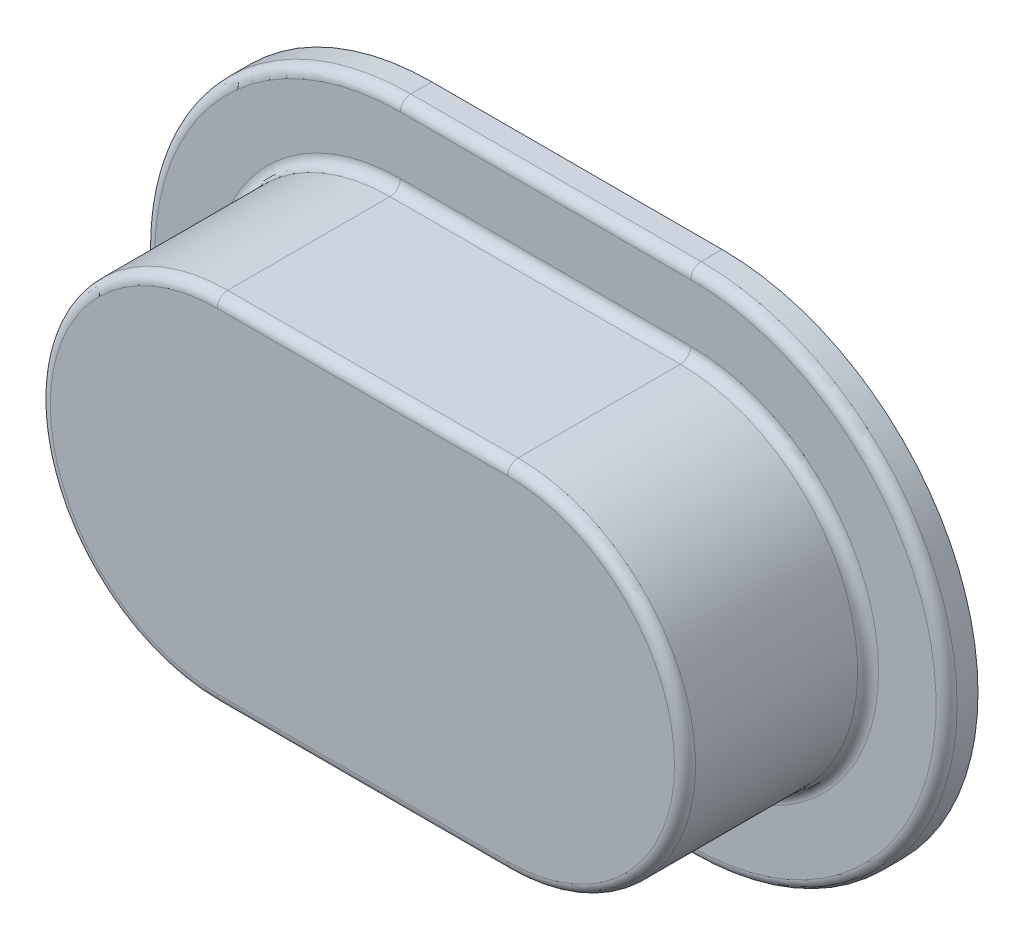
ISO-10303-21;
HEADER;
FILE_DESCRIPTION(('STEP AP214'),'2;1');
FILE_NAME('part.step','',(''),(''),'','','');
FILE_SCHEMA(('AUTOMOTIVE_DESIGN { 1 0 10303 214 1 1 1 1 }'));
ENDSEC;
DATA;
#1=APPLICATION_CONTEXT('core data for automotive mechanical design processes');
#2=APPLICATION_PROTOCOL_DEFINITION('international standard','automotive_design',2000,#1);
#3=PRODUCT_CONTEXT('',#1,'mechanical');
#4=PRODUCT('Part','Part','',(#3));
#5=PRODUCT_RELATED_PRODUCT_CATEGORY('part','',(#4));
#6=PRODUCT_DEFINITION_FORMATION('','',#4);
#7=PRODUCT_DEFINITION_CONTEXT('part definition',#1,'design');
#8=PRODUCT_DEFINITION('design','',#6,#7);
#9=PRODUCT_DEFINITION_SHAPE('','',#8);
#10=(LENGTH_UNIT() NAMED_UNIT(*) SI_UNIT(.MILLI.,.METRE.));
#11=(NAMED_UNIT(*) PLANE_ANGLE_UNIT() SI_UNIT($,.RADIAN.));
#12=(NAMED_UNIT(*) SI_UNIT($,.STERADIAN.) SOLID_ANGLE_UNIT());
#13=UNCERTAINTY_MEASURE_WITH_UNIT(LENGTH_MEASURE(1.E-05),#10,'distance_accuracy_value','');
#14=(GEOMETRIC_REPRESENTATION_CONTEXT(3) GLOBAL_UNCERTAINTY_ASSIGNED_CONTEXT((#13)) GLOBAL_UNIT_ASSIGNED_CONTEXT((#10,
#11,#12)) REPRESENTATION_CONTEXT('',''));
#15=CARTESIAN_POINT('',(0.,0.,0.));
#16=DIRECTION('',(0.,0.,1.));
#17=DIRECTION('',(1.,0.,0.));
#18=AXIS2_PLACEMENT_3D('',#15,#16,#17);
#19=CARTESIAN_POINT('',(-27.4999999999999,90.5,6.));
#20=DIRECTION('',(0.,0.,-1.));
#21=DIRECTION('',(-1.,0.,0.));
#22=AXIS2_PLACEMENT_3D('',#19,#20,#21);
#23=CYLINDRICAL_SURFACE('',#22,48.9085956407228);
#24=DIRECTION('',(0.,0.,-1.));
#25=VECTOR('',#24,1.);
#26=CARTESIAN_POINT('',(-27.4999999999999,41.5914043592772,6.));
#27=LINE('',#26,#25);
#28=CARTESIAN_POINT('',(-27.4999999999999,41.5914043592772,4.));
#29=VERTEX_POINT('',#28);
#30=CARTESIAN_POINT('',(-27.4999999999999,41.5914043592772,0.));
#31=VERTEX_POINT('',#30);
#32=EDGE_CURVE('E368',#29,#31,#27,.T.);
#33=ORIENTED_EDGE('',*,*,#32,.F.);
#34=CARTESIAN_POINT('',(-27.4999999999999,90.5,4.));
#35=DIRECTION('',(0.,0.,1.));
#36=DIRECTION('',(1.,0.,0.));
#37=AXIS2_PLACEMENT_3D('',#34,#35,#36);
#38=CIRCLE('',#37,48.9085956407228);
#39=CARTESIAN_POINT('',(-27.4999999999999,139.408595640723,4.));
#40=VERTEX_POINT('',#39);
#41=EDGE_CURVE('E421',#29,#40,#38,.F.);
#42=ORIENTED_EDGE('',*,*,#41,.T.);
#43=DIRECTION('',(0.,0.,-1.));
#44=VECTOR('',#43,1.);
#45=CARTESIAN_POINT('',(-27.4999999999999,139.408595640723,6.));
#46=LINE('',#45,#44);
#47=CARTESIAN_POINT('',(-27.4999999999999,139.408595640723,0.));
#48=VERTEX_POINT('',#47);
#49=EDGE_CURVE('E359',#40,#48,#46,.T.);
#50=ORIENTED_EDGE('',*,*,#49,.T.);
#51=CARTESIAN_POINT('',(-27.4999999999999,90.5,0.));
#52=DIRECTION('',(0.,0.,1.));
#53=DIRECTION('',(1.,0.,0.));
#54=AXIS2_PLACEMENT_3D('',#51,#52,#53);
#55=CIRCLE('',#54,48.9085956407228);
#56=EDGE_CURVE('E343',#48,#31,#55,.T.);
#57=ORIENTED_EDGE('',*,*,#56,.T.);
#58=EDGE_LOOP('',(#33,#42,#50,#57));
#59=FACE_BOUND('',#58,.T.);
#60=ADVANCED_FACE('F38',(#59),#23,.T.);
#61=CARTESIAN_POINT('',(-27.4999999999999,41.5914043592772,6.));
#62=DIRECTION('',(0.,1.,0.));
#63=DIRECTION('',(-1.,0.,0.));
#64=AXIS2_PLACEMENT_3D('',#61,#62,#63);
#65=PLANE('',#64);
#66=DIRECTION('',(0.,0.,-1.));
#67=VECTOR('',#66,1.);
#68=CARTESIAN_POINT('',(27.9999999999998,41.5914043592773,6.));
#69=LINE('',#68,#67);
#70=CARTESIAN_POINT('',(27.9999999999998,41.5914043592773,4.));
#71=VERTEX_POINT('',#70);
#72=CARTESIAN_POINT('',(27.9999999999998,41.5914043592773,0.));
#73=VERTEX_POINT('',#72);
#74=EDGE_CURVE('E365',#71,#73,#69,.T.);
#75=ORIENTED_EDGE('',*,*,#74,.F.);
#76=DIRECTION('',(1.,0.,0.));
#77=VECTOR('',#76,1.);
#78=CARTESIAN_POINT('',(-27.4999999999999,41.5914043592772,4.));
#79=LINE('',#78,#77);
#80=EDGE_CURVE('E417',#71,#29,#79,.F.);
#81=ORIENTED_EDGE('',*,*,#80,.T.);
#82=ORIENTED_EDGE('',*,*,#32,.T.);
#83=DIRECTION('',(1.,0.,0.));
#84=VECTOR('',#83,1.);
#85=CARTESIAN_POINT('',(-27.4999999999999,41.5914043592772,0.));
#86=LINE('',#85,#84);
#87=EDGE_CURVE('E347',#31,#73,#86,.T.);
#88=ORIENTED_EDGE('',*,*,#87,.T.);
#89=EDGE_LOOP('',(#75,#81,#82,#88));
#90=FACE_BOUND('',#89,.T.);
#91=ADVANCED_FACE('F538',(#90),#65,.F.);
#92=CARTESIAN_POINT('',(27.9999999999998,90.5000000000001,6.));
#93=DIRECTION('',(0.,0.,-1.));
#94=DIRECTION('',(-1.,0.,0.));
#95=AXIS2_PLACEMENT_3D('',#92,#93,#94);
#96=CYLINDRICAL_SURFACE('',#95,48.9085956407228);
#97=DIRECTION('',(0.,0.,-1.));
#98=VECTOR('',#97,1.);
#99=CARTESIAN_POINT('',(27.9999999999998,139.408595640723,6.));
#100=LINE('',#99,#98);
#101=CARTESIAN_POINT('',(27.9999999999998,139.408595640723,4.));
#102=VERTEX_POINT('',#101);
#103=CARTESIAN_POINT('',(27.9999999999998,139.408595640723,0.));
#104=VERTEX_POINT('',#103);
#105=EDGE_CURVE('E362',#102,#104,#100,.T.);
#106=ORIENTED_EDGE('',*,*,#105,.F.);
#107=CARTESIAN_POINT('',(27.9999999999998,90.5000000000001,4.));
#108=DIRECTION('',(0.,0.,1.));
#109=DIRECTION('',(1.,0.,0.));
#110=AXIS2_PLACEMENT_3D('',#107,#108,#109);
#111=CIRCLE('',#110,48.9085956407228);
#112=EDGE_CURVE('E11',#102,#71,#111,.F.);
#113=ORIENTED_EDGE('',*,*,#112,.T.);
#114=ORIENTED_EDGE('',*,*,#74,.T.);
#115=CARTESIAN_POINT('',(27.9999999999998,90.5000000000001,0.));
#116=DIRECTION('',(0.,0.,1.));
#117=DIRECTION('',(1.,0.,0.));
#118=AXIS2_PLACEMENT_3D('',#115,#116,#117);
#119=CIRCLE('',#118,48.9085956407228);
#120=EDGE_CURVE('E351',#73,#104,#119,.T.);
#121=ORIENTED_EDGE('',*,*,#120,.T.);
#122=EDGE_LOOP('',(#106,#113,#114,#121));
#123=FACE_BOUND('',#122,.T.);
#124=ADVANCED_FACE('F544',(#123),#96,.T.);
#125=CARTESIAN_POINT('',(-27.4999999999999,139.408595640723,6.));
#126=DIRECTION('',(0.,-1.,0.));
#127=DIRECTION('',(0.,0.,-1.));
#128=AXIS2_PLACEMENT_3D('',#125,#126,#127);
#129=PLANE('',#128);
#130=ORIENTED_EDGE('',*,*,#49,.F.);
#131=DIRECTION('',(-1.,0.,0.));
#132=VECTOR('',#131,1.);
#133=CARTESIAN_POINT('',(27.9999999999998,139.408595640723,4.));
#134=LINE('',#133,#132);
#135=EDGE_CURVE('E424',#40,#102,#134,.F.);
#136=ORIENTED_EDGE('',*,*,#135,.T.);
#137=ORIENTED_EDGE('',*,*,#105,.T.);
#138=DIRECTION('',(-1.,0.,0.));
#139=VECTOR('',#138,1.);
#140=CARTESIAN_POINT('',(-27.4999999999999,139.408595640723,0.));
#141=LINE('',#140,#139);
#142=EDGE_CURVE('E355',#104,#48,#141,.T.);
#143=ORIENTED_EDGE('',*,*,#142,.T.);
#144=EDGE_LOOP('',(#130,#136,#137,#143));
#145=FACE_BOUND('',#144,.T.);
#146=ADVANCED_FACE('F653',(#145),#129,.F.);
#147=CARTESIAN_POINT('',(-27.4999999999999,90.5,6.));
#148=DIRECTION('',(0.,0.,1.));
#149=DIRECTION('',(1.,0.,0.));
#150=AXIS2_PLACEMENT_3D('',#147,#148,#149);
#151=PLANE('',#150);
#152=DIRECTION('',(-1.,0.,0.));
#153=VECTOR('',#152,1.);
#154=CARTESIAN_POINT('',(-27.4999999999999,126.408595640723,6.));
#155=LINE('',#154,#153);
#156=CARTESIAN_POINT('',(-27.4999999999999,126.408595640723,6.));
#157=VERTEX_POINT('',#156);
#158=CARTESIAN_POINT('',(27.9999999999998,126.408595640723,6.));
#159=VERTEX_POINT('',#158);
#160=EDGE_CURVE('E391',#157,#159,#155,.F.);
#161=ORIENTED_EDGE('',*,*,#160,.T.);
#162=CARTESIAN_POINT('',(27.9999999999998,90.5000000000001,6.));
#163=DIRECTION('',(0.,0.,1.));
#164=DIRECTION('',(1.,0.,0.));
#165=AXIS2_PLACEMENT_3D('',#162,#163,#164);
#166=CIRCLE('',#165,35.9085956407228);
#167=CARTESIAN_POINT('',(27.9999999999997,54.5914043592773,6.));
#168=VERTEX_POINT('',#167);
#169=EDGE_CURVE('E400',#159,#168,#166,.F.);
#170=ORIENTED_EDGE('',*,*,#169,.T.);
#171=DIRECTION('',(1.,0.,0.));
#172=VECTOR('',#171,1.);
#173=CARTESIAN_POINT('',(-27.4999999999998,54.5914043592772,6.));
#174=LINE('',#173,#172);
#175=CARTESIAN_POINT('',(-27.4999999999999,54.5914043592772,6.));
#176=VERTEX_POINT('',#175);
#177=EDGE_CURVE('E397',#168,#176,#174,.F.);
#178=ORIENTED_EDGE('',*,*,#177,.T.);
#179=CARTESIAN_POINT('',(-27.4999999999999,90.5,6.));
#180=DIRECTION('',(0.,0.,1.));
#181=DIRECTION('',(1.,0.,0.));
#182=AXIS2_PLACEMENT_3D('',#179,#180,#181);
#183=CIRCLE('',#182,35.9085956407228);
#184=EDGE_CURVE('E394',#176,#157,#183,.F.);
#185=ORIENTED_EDGE('',*,*,#184,.T.);
#186=EDGE_LOOP('',(#161,#170,#178,#185));
#187=FACE_BOUND('',#186,.T.);
#188=CARTESIAN_POINT('',(-27.4999999999999,90.5,6.));
#189=DIRECTION('',(0.,0.,1.));
#190=DIRECTION('',(1.,0.,0.));
#191=AXIS2_PLACEMENT_3D('',#188,#189,#190);
#192=CIRCLE('',#191,46.9085956407228);
#193=CARTESIAN_POINT('',(-27.4999999999999,137.408595640723,6.));
#194=VERTEX_POINT('',#193);
#195=CARTESIAN_POINT('',(-27.4999999999999,43.5914043592772,6.));
#196=VERTEX_POINT('',#195);
#197=EDGE_CURVE('E384',#194,#196,#192,.T.);
#198=ORIENTED_EDGE('',*,*,#197,.T.);
#199=DIRECTION('',(1.,0.,0.));
#200=VECTOR('',#199,1.);
#201=CARTESIAN_POINT('',(27.9999999999998,43.5914043592773,6.));
#202=LINE('',#201,#200);
#203=CARTESIAN_POINT('',(27.9999999999998,43.5914043592773,6.));
#204=VERTEX_POINT('',#203);
#205=EDGE_CURVE('E387',#196,#204,#202,.T.);
#206=ORIENTED_EDGE('',*,*,#205,.T.);
#207=CARTESIAN_POINT('',(27.9999999999998,90.5000000000001,6.));
#208=DIRECTION('',(0.,0.,1.));
#209=DIRECTION('',(1.,0.,0.));
#210=AXIS2_PLACEMENT_3D('',#207,#208,#209);
#211=CIRCLE('',#210,46.9085956407228);
#212=CARTESIAN_POINT('',(27.9999999999998,137.408595640723,6.));
#213=VERTEX_POINT('',#212);
#214=EDGE_CURVE('E378',#204,#213,#211,.T.);
#215=ORIENTED_EDGE('',*,*,#214,.T.);
#216=DIRECTION('',(-1.,0.,0.));
#217=VECTOR('',#216,1.);
#218=CARTESIAN_POINT('',(-27.4999999999999,137.408595640723,6.));
#219=LINE('',#218,#217);
#220=EDGE_CURVE('E381',#213,#194,#219,.T.);
#221=ORIENTED_EDGE('',*,*,#220,.T.);
#222=EDGE_LOOP('',(#198,#206,#215,#221));
#223=FACE_BOUND('',#222,.T.);
#224=ADVANCED_FACE('F643',(#187,#223),#151,.T.);
#225=CARTESIAN_POINT('',(-27.4999999999999,90.5,0.));
#226=DIRECTION('',(0.,0.,1.));
#227=DIRECTION('',(1.,0.,0.));
#228=AXIS2_PLACEMENT_3D('',#225,#226,#227);
#229=PLANE('',#228);
#230=DIRECTION('',(-1.,0.,0.));
#231=VECTOR('',#230,1.);
#232=CARTESIAN_POINT('',(-27.4999999999999,137.408595640723,0.));
#233=LINE('',#232,#231);
#234=CARTESIAN_POINT('',(27.9999999999998,137.408595640723,0.));
#235=VERTEX_POINT('',#234);
#236=CARTESIAN_POINT('',(-27.4999999999999,137.408595640723,0.));
#237=VERTEX_POINT('',#236);
#238=EDGE_CURVE('E241',#235,#237,#233,.T.);
#239=ORIENTED_EDGE('',*,*,#238,.T.);
#240=CARTESIAN_POINT('',(-27.4999999999999,90.5,0.));
#241=DIRECTION('',(0.,0.,1.));
#242=DIRECTION('',(1.,0.,0.));
#243=AXIS2_PLACEMENT_3D('',#240,#241,#242);
#244=CIRCLE('',#243,46.9085956407228);
#245=CARTESIAN_POINT('',(-27.4999999999999,43.5914043592772,0.));
#246=VERTEX_POINT('',#245);
#247=EDGE_CURVE('E282',#237,#246,#244,.T.);
#248=ORIENTED_EDGE('',*,*,#247,.T.);
#249=DIRECTION('',(1.,0.,0.));
#250=VECTOR('',#249,1.);
#251=CARTESIAN_POINT('',(-27.4999999999999,43.5914043592772,0.));
#252=LINE('',#251,#250);
#253=CARTESIAN_POINT('',(27.9999999999998,43.5914043592773,0.));
#254=VERTEX_POINT('',#253);
#255=EDGE_CURVE('E208',#246,#254,#252,.T.);
#256=ORIENTED_EDGE('',*,*,#255,.T.);
#257=CARTESIAN_POINT('',(27.9999999999998,90.5000000000001,0.));
#258=DIRECTION('',(0.,0.,1.));
#259=DIRECTION('',(1.,0.,0.));
#260=AXIS2_PLACEMENT_3D('',#257,#258,#259);
#261=CIRCLE('',#260,46.9085956407228);
#262=EDGE_CURVE('E56',#254,#235,#261,.T.);
#263=ORIENTED_EDGE('',*,*,#262,.T.);
#264=EDGE_LOOP('',(#239,#248,#256,#263));
#265=FACE_BOUND('',#264,.T.);
#266=ORIENTED_EDGE('',*,*,#56,.F.);
#267=ORIENTED_EDGE('',*,*,#142,.F.);
#268=ORIENTED_EDGE('',*,*,#120,.F.);
#269=ORIENTED_EDGE('',*,*,#87,.F.);
#270=EDGE_LOOP('',(#266,#267,#268,#269));
#271=FACE_BOUND('',#270,.T.);
#272=ADVANCED_FACE('F634',(#265,#271),#229,.F.);
#273=CARTESIAN_POINT('',(-27.4999999999999,90.5,41.));
#274=DIRECTION('',(0.,0.,-1.));
#275=DIRECTION('',(-1.,0.,0.));
#276=AXIS2_PLACEMENT_3D('',#273,#274,#275);
#277=CYLINDRICAL_SURFACE('',#276,33.9085956407228);
#278=DIRECTION('',(0.,0.,-1.));
#279=VECTOR('',#278,1.);
#280=CARTESIAN_POINT('',(-27.4999999999999,124.408595640723,41.));
#281=LINE('',#280,#279);
#282=CARTESIAN_POINT('',(-27.4999999999999,124.408595640723,39.));
#283=VERTEX_POINT('',#282);
#284=CARTESIAN_POINT('',(-27.4999999999999,124.408595640723,8.));
#285=VERTEX_POINT('',#284);
#286=EDGE_CURVE('E326',#283,#285,#281,.T.);
#287=ORIENTED_EDGE('',*,*,#286,.T.);
#288=CARTESIAN_POINT('',(-27.4999999999999,90.5,8.));
#289=DIRECTION('',(0.,0.,1.));
#290=DIRECTION('',(1.,0.,0.));
#291=AXIS2_PLACEMENT_3D('',#288,#289,#290);
#292=CIRCLE('',#291,33.9085956407228);
#293=CARTESIAN_POINT('',(-27.4999999999999,56.5914043592772,8.));
#294=VERTEX_POINT('',#293);
#295=EDGE_CURVE('E414',#285,#294,#292,.T.);
#296=ORIENTED_EDGE('',*,*,#295,.T.);
#297=DIRECTION('',(0.,0.,-1.));
#298=VECTOR('',#297,1.);
#299=CARTESIAN_POINT('',(-27.4999999999999,56.5914043592772,41.));
#300=LINE('',#299,#298);
#301=CARTESIAN_POINT('',(-27.4999999999999,56.5914043592772,39.));
#302=VERTEX_POINT('',#301);
#303=EDGE_CURVE('E339',#302,#294,#300,.T.);
#304=ORIENTED_EDGE('',*,*,#303,.F.);
#305=CARTESIAN_POINT('',(-27.4999999999999,90.5,39.));
#306=DIRECTION('',(0.,0.,1.));
#307=DIRECTION('',(1.,0.,0.));
#308=AXIS2_PLACEMENT_3D('',#305,#306,#307);
#309=CIRCLE('',#308,33.9085956407228);
#310=EDGE_CURVE('E411',#302,#283,#309,.F.);
#311=ORIENTED_EDGE('',*,*,#310,.T.);
#312=EDGE_LOOP('',(#287,#296,#304,#311));
#313=FACE_BOUND('',#312,.T.);
#314=ADVANCED_FACE('F510',(#313),#277,.T.);
#315=CARTESIAN_POINT('',(-27.4999999999999,56.5914043592772,41.));
#316=DIRECTION('',(0.,1.,0.));
#317=DIRECTION('',(-1.,0.,0.));
#318=AXIS2_PLACEMENT_3D('',#315,#316,#317);
#319=PLANE('',#318);
#320=ORIENTED_EDGE('',*,*,#303,.T.);
#321=DIRECTION('',(1.,0.,0.));
#322=VECTOR('',#321,1.);
#323=CARTESIAN_POINT('',(-27.4999999999999,56.5914043592772,8.));
#324=LINE('',#323,#322);
#325=CARTESIAN_POINT('',(27.9999999999997,56.5914043592773,8.));
#326=VERTEX_POINT('',#325);
#327=EDGE_CURVE('E408',#294,#326,#324,.T.);
#328=ORIENTED_EDGE('',*,*,#327,.T.);
#329=DIRECTION('',(0.,0.,-1.));
#330=VECTOR('',#329,1.);
#331=CARTESIAN_POINT('',(27.9999999999997,56.5914043592773,41.));
#332=LINE('',#331,#330);
#333=CARTESIAN_POINT('',(27.9999999999997,56.5914043592773,39.));
#334=VERTEX_POINT('',#333);
#335=EDGE_CURVE('E335',#334,#326,#332,.T.);
#336=ORIENTED_EDGE('',*,*,#335,.F.);
#337=DIRECTION('',(1.,0.,0.));
#338=VECTOR('',#337,1.);
#339=CARTESIAN_POINT('',(-27.4999999999999,56.5914043592772,39.));
#340=LINE('',#339,#338);
#341=EDGE_CURVE('E404',#334,#302,#340,.F.);
#342=ORIENTED_EDGE('',*,*,#341,.T.);
#343=EDGE_LOOP('',(#320,#328,#336,#342));
#344=FACE_BOUND('',#343,.T.);
#345=ADVANCED_FACE('F520',(#344),#319,.F.);
#346=CARTESIAN_POINT('',(27.9999999999998,90.5000000000001,41.));
#347=DIRECTION('',(0.,0.,-1.));
#348=DIRECTION('',(-1.,0.,0.));
#349=AXIS2_PLACEMENT_3D('',#346,#347,#348);
#350=CYLINDRICAL_SURFACE('',#349,33.9085956407228);
#351=ORIENTED_EDGE('',*,*,#335,.T.);
#352=CARTESIAN_POINT('',(27.9999999999998,90.5000000000001,8.));
#353=DIRECTION('',(0.,0.,1.));
#354=DIRECTION('',(1.,0.,0.));
#355=AXIS2_PLACEMENT_3D('',#352,#353,#354);
#356=CIRCLE('',#355,33.9085956407228);
#357=CARTESIAN_POINT('',(27.9999999999998,124.408595640723,8.));
#358=VERTEX_POINT('',#357);
#359=EDGE_CURVE('E374',#326,#358,#356,.T.);
#360=ORIENTED_EDGE('',*,*,#359,.T.);
#361=DIRECTION('',(0.,0.,-1.));
#362=VECTOR('',#361,1.);
#363=CARTESIAN_POINT('',(27.9999999999998,124.408595640723,41.));
#364=LINE('',#363,#362);
#365=CARTESIAN_POINT('',(27.9999999999998,124.408595640723,39.));
#366=VERTEX_POINT('',#365);
#367=EDGE_CURVE('E330',#366,#358,#364,.T.);
#368=ORIENTED_EDGE('',*,*,#367,.F.);
#369=CARTESIAN_POINT('',(27.9999999999998,90.5000000000001,39.));
#370=DIRECTION('',(0.,0.,1.));
#371=DIRECTION('',(1.,0.,0.));
#372=AXIS2_PLACEMENT_3D('',#369,#370,#371);
#373=CIRCLE('',#372,33.9085956407228);
#374=EDGE_CURVE('E371',#366,#334,#373,.F.);
#375=ORIENTED_EDGE('',*,*,#374,.T.);
#376=EDGE_LOOP('',(#351,#360,#368,#375));
#377=FACE_BOUND('',#376,.T.);
#378=ADVANCED_FACE('F494',(#377),#350,.T.);
#379=CARTESIAN_POINT('',(27.9999999999998,124.408595640723,41.));
#380=DIRECTION('',(0.,-1.,0.));
#381=DIRECTION('',(0.,0.,-1.));
#382=AXIS2_PLACEMENT_3D('',#379,#380,#381);
#383=PLANE('',#382);
#384=ORIENTED_EDGE('',*,*,#286,.F.);
#385=DIRECTION('',(-1.,0.,0.));
#386=VECTOR('',#385,1.);
#387=CARTESIAN_POINT('',(27.9999999999998,124.408595640723,39.));
#388=LINE('',#387,#386);
#389=EDGE_CURVE('E48',#283,#366,#388,.F.);
#390=ORIENTED_EDGE('',*,*,#389,.T.);
#391=ORIENTED_EDGE('',*,*,#367,.T.);
#392=DIRECTION('',(-1.,0.,0.));
#393=VECTOR('',#392,1.);
#394=CARTESIAN_POINT('',(27.9999999999998,124.408595640723,8.));
#395=LINE('',#394,#393);
#396=EDGE_CURVE('E437',#358,#285,#395,.T.);
#397=ORIENTED_EDGE('',*,*,#396,.T.);
#398=EDGE_LOOP('',(#384,#390,#391,#397));
#399=FACE_BOUND('',#398,.T.);
#400=ADVANCED_FACE('F492',(#399),#383,.F.);
#401=CARTESIAN_POINT('',(-27.4999999999999,90.5,41.));
#402=DIRECTION('',(0.,0.,1.));
#403=DIRECTION('',(1.,0.,0.));
#404=AXIS2_PLACEMENT_3D('',#401,#402,#403);
#405=PLANE('',#404);
#406=CARTESIAN_POINT('',(-27.4999999999999,90.5,41.));
#407=DIRECTION('',(0.,0.,1.));
#408=DIRECTION('',(1.,0.,0.));
#409=AXIS2_PLACEMENT_3D('',#406,#407,#408);
#410=CIRCLE('',#409,31.9085956407228);
#411=CARTESIAN_POINT('',(-27.4999999999999,122.408595640723,41.));
#412=VERTEX_POINT('',#411);
#413=CARTESIAN_POINT('',(-27.4999999999999,58.5914043592772,41.));
#414=VERTEX_POINT('',#413);
#415=EDGE_CURVE('E64',#412,#414,#410,.T.);
#416=ORIENTED_EDGE('',*,*,#415,.T.);
#417=DIRECTION('',(1.,0.,0.));
#418=VECTOR('',#417,1.);
#419=CARTESIAN_POINT('',(27.9999999999997,58.5914043592773,41.));
#420=LINE('',#419,#418);
#421=CARTESIAN_POINT('',(27.9999999999997,58.5914043592773,41.));
#422=VERTEX_POINT('',#421);
#423=EDGE_CURVE('E435',#414,#422,#420,.T.);
#424=ORIENTED_EDGE('',*,*,#423,.T.);
#425=CARTESIAN_POINT('',(27.9999999999998,90.5000000000001,41.));
#426=DIRECTION('',(0.,0.,1.));
#427=DIRECTION('',(1.,0.,0.));
#428=AXIS2_PLACEMENT_3D('',#425,#426,#427);
#429=CIRCLE('',#428,31.9085956407228);
#430=CARTESIAN_POINT('',(27.9999999999998,122.408595640723,41.));
#431=VERTEX_POINT('',#430);
#432=EDGE_CURVE('E427',#422,#431,#429,.T.);
#433=ORIENTED_EDGE('',*,*,#432,.T.);
#434=DIRECTION('',(-1.,0.,0.));
#435=VECTOR('',#434,1.);
#436=CARTESIAN_POINT('',(-27.4999999999999,122.408595640723,41.));
#437=LINE('',#436,#435);
#438=EDGE_CURVE('E430',#431,#412,#437,.T.);
#439=ORIENTED_EDGE('',*,*,#438,.T.);
#440=EDGE_LOOP('',(#416,#424,#433,#439));
#441=FACE_BOUND('',#440,.T.);
#442=ADVANCED_FACE('F527',(#441),#405,.T.);
#443=CARTESIAN_POINT('',(-27.4999999999999,90.5,8.));
#444=DIRECTION('',(0.,0.,1.));
#445=DIRECTION('',(1.,0.,0.));
#446=AXIS2_PLACEMENT_3D('',#443,#444,#445);
#447=TOROIDAL_SURFACE('',#446,35.9085956407228,2.);
#448=CARTESIAN_POINT('',(-27.4999999999999,126.408595640723,8.));
#449=DIRECTION('',(-1.,0.,0.));
#450=DIRECTION('',(0.,0.,1.));
#451=AXIS2_PLACEMENT_3D('',#448,#449,#450);
#452=CIRCLE('',#451,2.);
#453=EDGE_CURVE('E449',#157,#285,#452,.T.);
#454=ORIENTED_EDGE('',*,*,#453,.F.);
#455=ORIENTED_EDGE('',*,*,#184,.F.);
#456=CARTESIAN_POINT('',(-27.4999999999999,54.5914043592772,8.));
#457=DIRECTION('',(-1.,0.,0.));
#458=DIRECTION('',(0.,0.,1.));
#459=AXIS2_PLACEMENT_3D('',#456,#457,#458);
#460=CIRCLE('',#459,2.);
#461=EDGE_CURVE('E331',#294,#176,#460,.T.);
#462=ORIENTED_EDGE('',*,*,#461,.F.);
#463=ORIENTED_EDGE('',*,*,#295,.F.);
#464=EDGE_LOOP('',(#454,#455,#462,#463));
#465=FACE_BOUND('',#464,.T.);
#466=ADVANCED_FACE('F514',(#465),#447,.F.);
#467=CARTESIAN_POINT('',(-27.4999999999999,54.5914043592772,8.));
#468=DIRECTION('',(1.,0.,0.));
#469=DIRECTION('',(0.,1.,0.));
#470=AXIS2_PLACEMENT_3D('',#467,#468,#469);
#471=CYLINDRICAL_SURFACE('',#470,2.);
#472=ORIENTED_EDGE('',*,*,#461,.T.);
#473=ORIENTED_EDGE('',*,*,#177,.F.);
#474=CARTESIAN_POINT('',(27.9999999999998,54.5914043592773,8.));
#475=DIRECTION('',(-1.,0.,0.));
#476=DIRECTION('',(0.,0.,1.));
#477=AXIS2_PLACEMENT_3D('',#474,#475,#476);
#478=CIRCLE('',#477,2.);
#479=EDGE_CURVE('E445',#326,#168,#478,.T.);
#480=ORIENTED_EDGE('',*,*,#479,.F.);
#481=ORIENTED_EDGE('',*,*,#327,.F.);
#482=EDGE_LOOP('',(#472,#473,#480,#481));
#483=FACE_BOUND('',#482,.T.);
#484=ADVANCED_FACE('F518',(#483),#471,.F.);
#485=CARTESIAN_POINT('',(27.9999999999998,126.408595640723,8.));
#486=DIRECTION('',(-1.,0.,0.));
#487=DIRECTION('',(0.,0.,1.));
#488=AXIS2_PLACEMENT_3D('',#485,#486,#487);
#489=CYLINDRICAL_SURFACE('',#488,2.);
#490=ORIENTED_EDGE('',*,*,#453,.T.);
#491=ORIENTED_EDGE('',*,*,#396,.F.);
#492=CARTESIAN_POINT('',(27.9999999999998,126.408595640723,8.));
#493=DIRECTION('',(-1.,0.,0.));
#494=DIRECTION('',(0.,0.,1.));
#495=AXIS2_PLACEMENT_3D('',#492,#493,#494);
#496=CIRCLE('',#495,2.);
#497=EDGE_CURVE('E442',#159,#358,#496,.T.);
#498=ORIENTED_EDGE('',*,*,#497,.F.);
#499=ORIENTED_EDGE('',*,*,#160,.F.);
#500=EDGE_LOOP('',(#490,#491,#498,#499));
#501=FACE_BOUND('',#500,.T.);
#502=ADVANCED_FACE('F506',(#501),#489,.F.);
#503=CARTESIAN_POINT('',(27.9999999999998,90.5000000000001,8.));
#504=DIRECTION('',(0.,0.,1.));
#505=DIRECTION('',(1.,0.,0.));
#506=AXIS2_PLACEMENT_3D('',#503,#504,#505);
#507=TOROIDAL_SURFACE('',#506,35.9085956407228,2.);
#508=ORIENTED_EDGE('',*,*,#479,.T.);
#509=ORIENTED_EDGE('',*,*,#169,.F.);
#510=ORIENTED_EDGE('',*,*,#497,.T.);
#511=ORIENTED_EDGE('',*,*,#359,.F.);
#512=EDGE_LOOP('',(#508,#509,#510,#511));
#513=FACE_BOUND('',#512,.T.);
#514=ADVANCED_FACE('F499',(#513),#507,.F.);
#515=CARTESIAN_POINT('',(-27.4999999999999,137.408595640723,4.));
#516=DIRECTION('',(1.,0.,0.));
#517=DIRECTION('',(0.,0.,-1.));
#518=AXIS2_PLACEMENT_3D('',#515,#516,#517);
#519=CYLINDRICAL_SURFACE('',#518,2.);
#520=CARTESIAN_POINT('',(27.9999999999998,137.408595640723,4.));
#521=DIRECTION('',(1.,0.,0.));
#522=DIRECTION('',(0.,0.,-1.));
#523=AXIS2_PLACEMENT_3D('',#520,#521,#522);
#524=CIRCLE('',#523,2.);
#525=EDGE_CURVE('E462',#102,#213,#524,.T.);
#526=ORIENTED_EDGE('',*,*,#525,.F.);
#527=ORIENTED_EDGE('',*,*,#135,.F.);
#528=CARTESIAN_POINT('',(-27.4999999999999,137.408595640723,4.));
#529=DIRECTION('',(-1.,0.,0.));
#530=DIRECTION('',(0.,0.,1.));
#531=AXIS2_PLACEMENT_3D('',#528,#529,#530);
#532=CIRCLE('',#531,2.);
#533=EDGE_CURVE('E446',#194,#40,#532,.T.);
#534=ORIENTED_EDGE('',*,*,#533,.F.);
#535=ORIENTED_EDGE('',*,*,#220,.F.);
#536=EDGE_LOOP('',(#526,#527,#534,#535));
#537=FACE_BOUND('',#536,.T.);
#538=ADVANCED_FACE('F552',(#537),#519,.T.);
#539=CARTESIAN_POINT('',(-27.4999999999999,90.5,4.));
#540=DIRECTION('',(0.,0.,1.));
#541=DIRECTION('',(1.,0.,0.));
#542=AXIS2_PLACEMENT_3D('',#539,#540,#541);
#543=TOROIDAL_SURFACE('',#542,46.9085956407228,2.);
#544=ORIENTED_EDGE('',*,*,#533,.T.);
#545=ORIENTED_EDGE('',*,*,#41,.F.);
#546=CARTESIAN_POINT('',(-27.4999999999999,43.5914043592772,4.));
#547=DIRECTION('',(1.,0.,0.));
#548=DIRECTION('',(0.,1.,0.));
#549=AXIS2_PLACEMENT_3D('',#546,#547,#548);
#550=CIRCLE('',#549,2.);
#551=EDGE_CURVE('E459',#196,#29,#550,.T.);
#552=ORIENTED_EDGE('',*,*,#551,.F.);
#553=ORIENTED_EDGE('',*,*,#197,.F.);
#554=EDGE_LOOP('',(#544,#545,#552,#553));
#555=FACE_BOUND('',#554,.T.);
#556=ADVANCED_FACE('F564',(#555),#543,.T.);
#557=CARTESIAN_POINT('',(27.9999999999998,90.5000000000001,4.));
#558=DIRECTION('',(0.,0.,1.));
#559=DIRECTION('',(1.,0.,0.));
#560=AXIS2_PLACEMENT_3D('',#557,#558,#559);
#561=TOROIDAL_SURFACE('',#560,46.9085956407228,2.);
#562=ORIENTED_EDGE('',*,*,#525,.T.);
#563=ORIENTED_EDGE('',*,*,#214,.F.);
#564=CARTESIAN_POINT('',(27.9999999999998,43.5914043592773,4.));
#565=DIRECTION('',(-1.,0.,0.));
#566=DIRECTION('',(0.,0.,1.));
#567=AXIS2_PLACEMENT_3D('',#564,#565,#566);
#568=CIRCLE('',#567,2.);
#569=EDGE_CURVE('E456',#71,#204,#568,.T.);
#570=ORIENTED_EDGE('',*,*,#569,.F.);
#571=ORIENTED_EDGE('',*,*,#112,.F.);
#572=EDGE_LOOP('',(#562,#563,#570,#571));
#573=FACE_BOUND('',#572,.T.);
#574=ADVANCED_FACE('F560',(#573),#561,.T.);
#575=CARTESIAN_POINT('',(-27.4999999999998,43.5914043592772,4.));
#576=DIRECTION('',(-1.,0.,0.));
#577=DIRECTION('',(0.,-1.,0.));
#578=AXIS2_PLACEMENT_3D('',#575,#576,#577);
#579=CYLINDRICAL_SURFACE('',#578,2.);
#580=ORIENTED_EDGE('',*,*,#551,.T.);
#581=ORIENTED_EDGE('',*,*,#80,.F.);
#582=ORIENTED_EDGE('',*,*,#569,.T.);
#583=ORIENTED_EDGE('',*,*,#205,.F.);
#584=EDGE_LOOP('',(#580,#581,#582,#583));
#585=FACE_BOUND('',#584,.T.);
#586=ADVANCED_FACE('F557',(#585),#579,.T.);
#587=CARTESIAN_POINT('',(-27.4999999999999,122.408595640723,39.));
#588=DIRECTION('',(1.,0.,0.));
#589=DIRECTION('',(0.,0.,-1.));
#590=AXIS2_PLACEMENT_3D('',#587,#588,#589);
#591=CYLINDRICAL_SURFACE('',#590,2.);
#592=CARTESIAN_POINT('',(27.9999999999998,122.408595640723,39.));
#593=DIRECTION('',(1.,0.,0.));
#594=DIRECTION('',(0.,0.,-1.));
#595=AXIS2_PLACEMENT_3D('',#592,#593,#594);
#596=CIRCLE('',#595,2.);
#597=EDGE_CURVE('E473',#366,#431,#596,.T.);
#598=ORIENTED_EDGE('',*,*,#597,.F.);
#599=ORIENTED_EDGE('',*,*,#389,.F.);
#600=CARTESIAN_POINT('',(-27.4999999999999,122.408595640723,39.));
#601=DIRECTION('',(-1.,0.,0.));
#602=DIRECTION('',(0.,0.,1.));
#603=AXIS2_PLACEMENT_3D('',#600,#601,#602);
#604=CIRCLE('',#603,2.);
#605=EDGE_CURVE('E42',#412,#283,#604,.T.);
#606=ORIENTED_EDGE('',*,*,#605,.F.);
#607=ORIENTED_EDGE('',*,*,#438,.F.);
#608=EDGE_LOOP('',(#598,#599,#606,#607));
#609=FACE_BOUND('',#608,.T.);
#610=ADVANCED_FACE('F40',(#609),#591,.T.);
#611=CARTESIAN_POINT('',(-27.4999999999999,90.5,39.));
#612=DIRECTION('',(0.,0.,1.));
#613=DIRECTION('',(1.,0.,0.));
#614=AXIS2_PLACEMENT_3D('',#611,#612,#613);
#615=TOROIDAL_SURFACE('',#614,31.9085956407228,2.);
#616=ORIENTED_EDGE('',*,*,#605,.T.);
#617=ORIENTED_EDGE('',*,*,#310,.F.);
#618=CARTESIAN_POINT('',(-27.4999999999999,58.5914043592772,39.));
#619=DIRECTION('',(1.,0.,0.));
#620=DIRECTION('',(0.,1.,0.));
#621=AXIS2_PLACEMENT_3D('',#618,#619,#620);
#622=CIRCLE('',#621,2.);
#623=EDGE_CURVE('E471',#414,#302,#622,.T.);
#624=ORIENTED_EDGE('',*,*,#623,.F.);
#625=ORIENTED_EDGE('',*,*,#415,.F.);
#626=EDGE_LOOP('',(#616,#617,#624,#625));
#627=FACE_BOUND('',#626,.T.);
#628=ADVANCED_FACE('F485',(#627),#615,.T.);
#629=CARTESIAN_POINT('',(27.9999999999998,90.5000000000001,39.));
#630=DIRECTION('',(0.,0.,1.));
#631=DIRECTION('',(1.,0.,0.));
#632=AXIS2_PLACEMENT_3D('',#629,#630,#631);
#633=TOROIDAL_SURFACE('',#632,31.9085956407228,2.);
#634=ORIENTED_EDGE('',*,*,#597,.T.);
#635=ORIENTED_EDGE('',*,*,#432,.F.);
#636=CARTESIAN_POINT('',(27.9999999999998,58.5914043592773,39.));
#637=DIRECTION('',(-1.,0.,0.));
#638=DIRECTION('',(0.,0.,1.));
#639=AXIS2_PLACEMENT_3D('',#636,#637,#638);
#640=CIRCLE('',#639,2.);
#641=EDGE_CURVE('E309',#334,#422,#640,.T.);
#642=ORIENTED_EDGE('',*,*,#641,.F.);
#643=ORIENTED_EDGE('',*,*,#374,.F.);
#644=EDGE_LOOP('',(#634,#635,#642,#643));
#645=FACE_BOUND('',#644,.T.);
#646=ADVANCED_FACE('F526',(#645),#633,.T.);
#647=CARTESIAN_POINT('',(-27.4999999999998,58.5914043592772,39.));
#648=DIRECTION('',(-1.,0.,0.));
#649=DIRECTION('',(0.,-1.,0.));
#650=AXIS2_PLACEMENT_3D('',#647,#648,#649);
#651=CYLINDRICAL_SURFACE('',#650,2.);
#652=ORIENTED_EDGE('',*,*,#623,.T.);
#653=ORIENTED_EDGE('',*,*,#341,.F.);
#654=ORIENTED_EDGE('',*,*,#641,.T.);
#655=ORIENTED_EDGE('',*,*,#423,.F.);
#656=EDGE_LOOP('',(#652,#653,#654,#655));
#657=FACE_BOUND('',#656,.T.);
#658=ADVANCED_FACE('F524',(#657),#651,.T.);
#659=CARTESIAN_POINT('',(-27.4999999999999,90.5,6.));
#660=DIRECTION('',(0.,0.,-1.));
#661=DIRECTION('',(-1.,0.,0.));
#662=AXIS2_PLACEMENT_3D('',#659,#660,#661);
#663=CYLINDRICAL_SURFACE('',#662,46.9085956407228);
#664=DIRECTION('',(0.,0.,1.));
#665=VECTOR('',#664,1.);
#666=CARTESIAN_POINT('',(-27.4999999999999,43.5914043592772,6.));
#667=LINE('',#666,#665);
#668=CARTESIAN_POINT('',(-27.4999999999999,43.5914043592772,4.));
#669=VERTEX_POINT('',#668);
#670=EDGE_CURVE('E202',#669,#246,#667,.F.);
#671=ORIENTED_EDGE('',*,*,#670,.T.);
#672=ORIENTED_EDGE('',*,*,#247,.F.);
#673=DIRECTION('',(0.,0.,-1.));
#674=VECTOR('',#673,1.);
#675=CARTESIAN_POINT('',(-27.4999999999999,137.408595640723,6.));
#676=LINE('',#675,#674);
#677=CARTESIAN_POINT('',(-27.4999999999999,137.408595640723,4.));
#678=VERTEX_POINT('',#677);
#679=EDGE_CURVE('E228',#678,#237,#676,.T.);
#680=ORIENTED_EDGE('',*,*,#679,.F.);
#681=CARTESIAN_POINT('',(-27.4999999999999,90.5,4.));
#682=DIRECTION('',(0.,0.,1.));
#683=DIRECTION('',(1.,0.,0.));
#684=AXIS2_PLACEMENT_3D('',#681,#682,#683);
#685=CIRCLE('',#684,46.9085956407228);
#686=EDGE_CURVE('E221',#669,#678,#685,.F.);
#687=ORIENTED_EDGE('',*,*,#686,.F.);
#688=EDGE_LOOP('',(#671,#672,#680,#687));
#689=FACE_BOUND('',#688,.T.);
#690=ADVANCED_FACE('F227',(#689),#663,.F.);
#691=CARTESIAN_POINT('',(-27.4999999999999,43.5914043592772,6.));
#692=DIRECTION('',(0.,1.,0.));
#693=DIRECTION('',(-1.,0.,0.));
#694=AXIS2_PLACEMENT_3D('',#691,#692,#693);
#695=PLANE('',#694);
#696=DIRECTION('',(0.,0.,-1.));
#697=VECTOR('',#696,1.);
#698=CARTESIAN_POINT('',(27.9999999999998,43.5914043592773,6.));
#699=LINE('',#698,#697);
#700=CARTESIAN_POINT('',(27.9999999999998,43.5914043592773,4.));
#701=VERTEX_POINT('',#700);
#702=EDGE_CURVE('E215',#701,#254,#699,.T.);
#703=ORIENTED_EDGE('',*,*,#702,.T.);
#704=ORIENTED_EDGE('',*,*,#255,.F.);
#705=ORIENTED_EDGE('',*,*,#670,.F.);
#706=DIRECTION('',(-1.,0.,0.));
#707=VECTOR('',#706,1.);
#708=CARTESIAN_POINT('',(-27.4999999999998,43.5914043592772,4.));
#709=LINE('',#708,#707);
#710=EDGE_CURVE('E205',#701,#669,#709,.T.);
#711=ORIENTED_EDGE('',*,*,#710,.F.);
#712=EDGE_LOOP('',(#703,#704,#705,#711));
#713=FACE_BOUND('',#712,.T.);
#714=ADVANCED_FACE('F204',(#713),#695,.T.);
#715=CARTESIAN_POINT('',(27.9999999999998,90.5000000000001,6.));
#716=DIRECTION('',(0.,0.,-1.));
#717=DIRECTION('',(-1.,0.,0.));
#718=AXIS2_PLACEMENT_3D('',#715,#716,#717);
#719=CYLINDRICAL_SURFACE('',#718,46.9085956407228);
#720=DIRECTION('',(0.,0.,-1.));
#721=VECTOR('',#720,1.);
#722=CARTESIAN_POINT('',(27.9999999999998,137.408595640723,6.));
#723=LINE('',#722,#721);
#724=CARTESIAN_POINT('',(27.9999999999998,137.408595640723,4.));
#725=VERTEX_POINT('',#724);
#726=EDGE_CURVE('E240',#725,#235,#723,.T.);
#727=ORIENTED_EDGE('',*,*,#726,.T.);
#728=ORIENTED_EDGE('',*,*,#262,.F.);
#729=ORIENTED_EDGE('',*,*,#702,.F.);
#730=CARTESIAN_POINT('',(27.9999999999998,90.5000000000001,4.));
#731=DIRECTION('',(0.,0.,1.));
#732=DIRECTION('',(1.,0.,0.));
#733=AXIS2_PLACEMENT_3D('',#730,#731,#732);
#734=CIRCLE('',#733,46.9085956407228);
#735=EDGE_CURVE('E223',#701,#725,#734,.T.);
#736=ORIENTED_EDGE('',*,*,#735,.T.);
#737=EDGE_LOOP('',(#727,#728,#729,#736));
#738=FACE_BOUND('',#737,.T.);
#739=ADVANCED_FACE('F766',(#738),#719,.F.);
#740=CARTESIAN_POINT('',(-27.4999999999999,137.408595640723,6.));
#741=DIRECTION('',(0.,-1.,0.));
#742=DIRECTION('',(0.,0.,-1.));
#743=AXIS2_PLACEMENT_3D('',#740,#741,#742);
#744=PLANE('',#743);
#745=ORIENTED_EDGE('',*,*,#679,.T.);
#746=ORIENTED_EDGE('',*,*,#238,.F.);
#747=ORIENTED_EDGE('',*,*,#726,.F.);
#748=DIRECTION('',(1.,0.,0.));
#749=VECTOR('',#748,1.);
#750=CARTESIAN_POINT('',(-27.4999999999999,137.408595640723,4.));
#751=LINE('',#750,#749);
#752=EDGE_CURVE('E230',#678,#725,#751,.T.);
#753=ORIENTED_EDGE('',*,*,#752,.F.);
#754=EDGE_LOOP('',(#745,#746,#747,#753));
#755=FACE_BOUND('',#754,.T.);
#756=ADVANCED_FACE('F775',(#755),#744,.T.);
#757=CARTESIAN_POINT('',(-27.4999999999999,90.5,4.));
#758=DIRECTION('',(0.,0.,1.));
#759=DIRECTION('',(1.,0.,0.));
#760=AXIS2_PLACEMENT_3D('',#757,#758,#759);
#761=PLANE('',#760);
#762=DIRECTION('',(1.,0.,0.));
#763=VECTOR('',#762,1.);
#764=CARTESIAN_POINT('',(-27.4999999999999,126.408595640723,4.));
#765=LINE('',#764,#763);
#766=CARTESIAN_POINT('',(-27.4999999999999,126.408595640723,4.));
#767=VERTEX_POINT('',#766);
#768=CARTESIAN_POINT('',(27.9999999999998,126.408595640723,4.));
#769=VERTEX_POINT('',#768);
#770=EDGE_CURVE('E247',#767,#769,#765,.T.);
#771=ORIENTED_EDGE('',*,*,#770,.F.);
#772=CARTESIAN_POINT('',(-27.4999999999999,90.5,4.));
#773=DIRECTION('',(0.,0.,1.));
#774=DIRECTION('',(1.,0.,0.));
#775=AXIS2_PLACEMENT_3D('',#772,#773,#774);
#776=CIRCLE('',#775,35.9085956407228);
#777=CARTESIAN_POINT('',(-27.4999999999999,54.5914043592772,4.));
#778=VERTEX_POINT('',#777);
#779=EDGE_CURVE('E251',#778,#767,#776,.F.);
#780=ORIENTED_EDGE('',*,*,#779,.F.);
#781=DIRECTION('',(1.,0.,0.));
#782=VECTOR('',#781,1.);
#783=CARTESIAN_POINT('',(-27.4999999999999,54.5914043592773,4.));
#784=LINE('',#783,#782);
#785=CARTESIAN_POINT('',(27.9999999999997,54.5914043592773,4.));
#786=VERTEX_POINT('',#785);
#787=EDGE_CURVE('E257',#786,#778,#784,.F.);
#788=ORIENTED_EDGE('',*,*,#787,.F.);
#789=CARTESIAN_POINT('',(27.9999999999998,90.5000000000001,4.));
#790=DIRECTION('',(0.,0.,1.));
#791=DIRECTION('',(1.,0.,0.));
#792=AXIS2_PLACEMENT_3D('',#789,#790,#791);
#793=CIRCLE('',#792,35.9085956407228);
#794=EDGE_CURVE('E252',#769,#786,#793,.F.);
#795=ORIENTED_EDGE('',*,*,#794,.F.);
#796=EDGE_LOOP('',(#771,#780,#788,#795));
#797=FACE_BOUND('',#796,.T.);
#798=ORIENTED_EDGE('',*,*,#686,.T.);
#799=ORIENTED_EDGE('',*,*,#752,.T.);
#800=ORIENTED_EDGE('',*,*,#735,.F.);
#801=ORIENTED_EDGE('',*,*,#710,.T.);
#802=EDGE_LOOP('',(#798,#799,#800,#801));
#803=FACE_BOUND('',#802,.T.);
#804=ADVANCED_FACE('F219',(#797,#803),#761,.F.);
#805=CARTESIAN_POINT('',(-27.4999999999999,90.5,41.));
#806=DIRECTION('',(0.,0.,-1.));
#807=DIRECTION('',(-1.,0.,0.));
#808=AXIS2_PLACEMENT_3D('',#805,#806,#807);
#809=CYLINDRICAL_SURFACE('',#808,31.9085956407228);
#810=DIRECTION('',(0.,0.,-1.));
#811=VECTOR('',#810,1.);
#812=CARTESIAN_POINT('',(-27.4999999999999,122.408595640723,41.));
#813=LINE('',#812,#811);
#814=CARTESIAN_POINT('',(-27.4999999999999,122.408595640723,39.));
#815=VERTEX_POINT('',#814);
#816=CARTESIAN_POINT('',(-27.4999999999999,122.408595640723,8.));
#817=VERTEX_POINT('',#816);
#818=EDGE_CURVE('E270',#815,#817,#813,.T.);
#819=ORIENTED_EDGE('',*,*,#818,.F.);
#820=CARTESIAN_POINT('',(-27.4999999999999,90.5,39.));
#821=DIRECTION('',(0.,0.,1.));
#822=DIRECTION('',(1.,0.,0.));
#823=AXIS2_PLACEMENT_3D('',#820,#821,#822);
#824=CIRCLE('',#823,31.9085956407228);
#825=CARTESIAN_POINT('',(-27.4999999999999,58.5914043592772,39.));
#826=VERTEX_POINT('',#825);
#827=EDGE_CURVE('E273',#826,#815,#824,.F.);
#828=ORIENTED_EDGE('',*,*,#827,.F.);
#829=DIRECTION('',(0.,0.,1.));
#830=VECTOR('',#829,1.);
#831=CARTESIAN_POINT('',(-27.4999999999999,58.5914043592772,41.));
#832=LINE('',#831,#830);
#833=CARTESIAN_POINT('',(-27.4999999999999,58.5914043592772,8.));
#834=VERTEX_POINT('',#833);
#835=EDGE_CURVE('E278',#826,#834,#832,.F.);
#836=ORIENTED_EDGE('',*,*,#835,.T.);
#837=CARTESIAN_POINT('',(-27.4999999999999,90.5,8.));
#838=DIRECTION('',(0.,0.,-1.));
#839=DIRECTION('',(-1.,0.,0.));
#840=AXIS2_PLACEMENT_3D('',#837,#838,#839);
#841=CIRCLE('',#840,31.9085956407228);
#842=EDGE_CURVE('E225',#817,#834,#841,.F.);
#843=ORIENTED_EDGE('',*,*,#842,.F.);
#844=EDGE_LOOP('',(#819,#828,#836,#843));
#845=FACE_BOUND('',#844,.T.);
#846=ADVANCED_FACE('F793',(#845),#809,.F.);
#847=CARTESIAN_POINT('',(-27.4999999999999,58.5914043592772,41.));
#848=DIRECTION('',(0.,1.,0.));
#849=DIRECTION('',(-1.,0.,0.));
#850=AXIS2_PLACEMENT_3D('',#847,#848,#849);
#851=PLANE('',#850);
#852=ORIENTED_EDGE('',*,*,#835,.F.);
#853=DIRECTION('',(-1.,0.,0.));
#854=VECTOR('',#853,1.);
#855=CARTESIAN_POINT('',(-27.4999999999998,58.5914043592772,39.));
#856=LINE('',#855,#854);
#857=CARTESIAN_POINT('',(27.9999999999998,58.5914043592773,39.));
#858=VERTEX_POINT('',#857);
#859=EDGE_CURVE('E256',#858,#826,#856,.T.);
#860=ORIENTED_EDGE('',*,*,#859,.F.);
#861=DIRECTION('',(0.,0.,-1.));
#862=VECTOR('',#861,1.);
#863=CARTESIAN_POINT('',(27.9999999999998,58.5914043592773,41.));
#864=LINE('',#863,#862);
#865=CARTESIAN_POINT('',(27.9999999999997,58.5914043592773,8.));
#866=VERTEX_POINT('',#865);
#867=EDGE_CURVE('E283',#858,#866,#864,.T.);
#868=ORIENTED_EDGE('',*,*,#867,.T.);
#869=DIRECTION('',(-1.,0.,0.));
#870=VECTOR('',#869,1.);
#871=CARTESIAN_POINT('',(-27.4999999999999,58.5914043592772,8.));
#872=LINE('',#871,#870);
#873=EDGE_CURVE('E287',#834,#866,#872,.F.);
#874=ORIENTED_EDGE('',*,*,#873,.F.);
#875=EDGE_LOOP('',(#852,#860,#868,#874));
#876=FACE_BOUND('',#875,.T.);
#877=ADVANCED_FACE('F803',(#876),#851,.T.);
#878=CARTESIAN_POINT('',(27.9999999999998,90.5000000000001,41.));
#879=DIRECTION('',(0.,0.,-1.));
#880=DIRECTION('',(-1.,0.,0.));
#881=AXIS2_PLACEMENT_3D('',#878,#879,#880);
#882=CYLINDRICAL_SURFACE('',#881,31.9085956407228);
#883=ORIENTED_EDGE('',*,*,#867,.F.);
#884=CARTESIAN_POINT('',(27.9999999999998,90.5000000000001,39.));
#885=DIRECTION('',(0.,0.,1.));
#886=DIRECTION('',(1.,0.,0.));
#887=AXIS2_PLACEMENT_3D('',#884,#885,#886);
#888=CIRCLE('',#887,31.9085956407228);
#889=CARTESIAN_POINT('',(27.9999999999998,122.408595640723,39.));
#890=VERTEX_POINT('',#889);
#891=EDGE_CURVE('E235',#858,#890,#888,.T.);
#892=ORIENTED_EDGE('',*,*,#891,.T.);
#893=DIRECTION('',(0.,0.,-1.));
#894=VECTOR('',#893,1.);
#895=CARTESIAN_POINT('',(27.9999999999998,122.408595640723,41.));
#896=LINE('',#895,#894);
#897=CARTESIAN_POINT('',(27.9999999999998,122.408595640723,8.));
#898=VERTEX_POINT('',#897);
#899=EDGE_CURVE('E277',#890,#898,#896,.T.);
#900=ORIENTED_EDGE('',*,*,#899,.T.);
#901=CARTESIAN_POINT('',(27.9999999999998,90.5000000000001,8.));
#902=DIRECTION('',(0.,0.,-1.));
#903=DIRECTION('',(-1.,0.,0.));
#904=AXIS2_PLACEMENT_3D('',#901,#902,#903);
#905=CIRCLE('',#904,31.9085956407228);
#906=EDGE_CURVE('E214',#866,#898,#905,.F.);
#907=ORIENTED_EDGE('',*,*,#906,.F.);
#908=EDGE_LOOP('',(#883,#892,#900,#907));
#909=FACE_BOUND('',#908,.T.);
#910=ADVANCED_FACE('F813',(#909),#882,.F.);
#911=CARTESIAN_POINT('',(27.9999999999998,122.408595640723,41.));
#912=DIRECTION('',(0.,-1.,0.));
#913=DIRECTION('',(0.,0.,-1.));
#914=AXIS2_PLACEMENT_3D('',#911,#912,#913);
#915=PLANE('',#914);
#916=ORIENTED_EDGE('',*,*,#818,.T.);
#917=DIRECTION('',(1.,0.,0.));
#918=VECTOR('',#917,1.);
#919=CARTESIAN_POINT('',(27.9999999999998,122.408595640723,8.));
#920=LINE('',#919,#918);
#921=EDGE_CURVE('E304',#898,#817,#920,.F.);
#922=ORIENTED_EDGE('',*,*,#921,.F.);
#923=ORIENTED_EDGE('',*,*,#899,.F.);
#924=DIRECTION('',(1.,0.,0.));
#925=VECTOR('',#924,1.);
#926=CARTESIAN_POINT('',(-27.4999999999999,122.408595640723,39.));
#927=LINE('',#926,#925);
#928=EDGE_CURVE('E305',#815,#890,#927,.T.);
#929=ORIENTED_EDGE('',*,*,#928,.F.);
#930=EDGE_LOOP('',(#916,#922,#923,#929));
#931=FACE_BOUND('',#930,.T.);
#932=ADVANCED_FACE('F823',(#931),#915,.T.);
#933=CARTESIAN_POINT('',(-27.4999999999999,90.5,39.));
#934=DIRECTION('',(0.,0.,1.));
#935=DIRECTION('',(1.,0.,0.));
#936=AXIS2_PLACEMENT_3D('',#933,#934,#935);
#937=PLANE('',#936);
#938=ORIENTED_EDGE('',*,*,#827,.T.);
#939=ORIENTED_EDGE('',*,*,#928,.T.);
#940=ORIENTED_EDGE('',*,*,#891,.F.);
#941=ORIENTED_EDGE('',*,*,#859,.T.);
#942=EDGE_LOOP('',(#938,#939,#940,#941));
#943=FACE_BOUND('',#942,.T.);
#944=ADVANCED_FACE('F833',(#943),#937,.F.);
#945=CARTESIAN_POINT('',(-27.4999999999999,90.5,8.));
#946=DIRECTION('',(0.,0.,1.));
#947=DIRECTION('',(1.,0.,0.));
#948=AXIS2_PLACEMENT_3D('',#945,#946,#947);
#949=TOROIDAL_SURFACE('',#948,35.9085956407228,4.);
#950=CARTESIAN_POINT('',(-27.4999999999999,126.408595640723,8.));
#951=DIRECTION('',(-1.,0.,0.));
#952=DIRECTION('',(0.,0.,1.));
#953=AXIS2_PLACEMENT_3D('',#950,#951,#952);
#954=CIRCLE('',#953,4.);
#955=EDGE_CURVE('E262',#767,#817,#954,.T.);
#956=ORIENTED_EDGE('',*,*,#955,.T.);
#957=ORIENTED_EDGE('',*,*,#842,.T.);
#958=CARTESIAN_POINT('',(-27.4999999999999,54.5914043592772,8.));
#959=DIRECTION('',(1.,0.,0.));
#960=DIRECTION('',(0.,1.,0.));
#961=AXIS2_PLACEMENT_3D('',#958,#959,#960);
#962=CIRCLE('',#961,4.);
#963=EDGE_CURVE('E266',#834,#778,#962,.F.);
#964=ORIENTED_EDGE('',*,*,#963,.T.);
#965=ORIENTED_EDGE('',*,*,#779,.T.);
#966=EDGE_LOOP('',(#956,#957,#964,#965));
#967=FACE_BOUND('',#966,.T.);
#968=ADVANCED_FACE('F843',(#967),#949,.T.);
#969=CARTESIAN_POINT('',(-27.4999999999999,54.5914043592772,8.));
#970=DIRECTION('',(1.,0.,0.));
#971=DIRECTION('',(0.,1.,0.));
#972=AXIS2_PLACEMENT_3D('',#969,#970,#971);
#973=CYLINDRICAL_SURFACE('',#972,4.);
#974=ORIENTED_EDGE('',*,*,#963,.F.);
#975=ORIENTED_EDGE('',*,*,#873,.T.);
#976=CARTESIAN_POINT('',(27.9999999999997,54.5914043592773,8.));
#977=DIRECTION('',(-1.,0.,0.));
#978=DIRECTION('',(0.,-1.,0.));
#979=AXIS2_PLACEMENT_3D('',#976,#977,#978);
#980=CIRCLE('',#979,4.);
#981=EDGE_CURVE('E267',#866,#786,#980,.T.);
#982=ORIENTED_EDGE('',*,*,#981,.T.);
#983=ORIENTED_EDGE('',*,*,#787,.T.);
#984=EDGE_LOOP('',(#974,#975,#982,#983));
#985=FACE_BOUND('',#984,.T.);
#986=ADVANCED_FACE('F853',(#985),#973,.T.);
#987=CARTESIAN_POINT('',(27.9999999999998,126.408595640723,8.));
#988=DIRECTION('',(-1.,0.,0.));
#989=DIRECTION('',(0.,0.,1.));
#990=AXIS2_PLACEMENT_3D('',#987,#988,#989);
#991=CYLINDRICAL_SURFACE('',#990,4.);
#992=ORIENTED_EDGE('',*,*,#955,.F.);
#993=ORIENTED_EDGE('',*,*,#770,.T.);
#994=CARTESIAN_POINT('',(27.9999999999998,126.408595640723,8.));
#995=DIRECTION('',(1.,0.,0.));
#996=DIRECTION('',(0.,1.,0.));
#997=AXIS2_PLACEMENT_3D('',#994,#995,#996);
#998=CIRCLE('',#997,4.);
#999=EDGE_CURVE('E312',#769,#898,#998,.F.);
#1000=ORIENTED_EDGE('',*,*,#999,.T.);
#1001=ORIENTED_EDGE('',*,*,#921,.T.);
#1002=EDGE_LOOP('',(#992,#993,#1000,#1001));
#1003=FACE_BOUND('',#1002,.T.);
#1004=ADVANCED_FACE('F863',(#1003),#991,.T.);
#1005=CARTESIAN_POINT('',(27.9999999999998,90.5000000000001,8.));
#1006=DIRECTION('',(0.,0.,1.));
#1007=DIRECTION('',(1.,0.,0.));
#1008=AXIS2_PLACEMENT_3D('',#1005,#1006,#1007);
#1009=TOROIDAL_SURFACE('',#1008,35.9085956407228,4.);
#1010=ORIENTED_EDGE('',*,*,#981,.F.);
#1011=ORIENTED_EDGE('',*,*,#906,.T.);
#1012=ORIENTED_EDGE('',*,*,#999,.F.);
#1013=ORIENTED_EDGE('',*,*,#794,.T.);
#1014=EDGE_LOOP('',(#1010,#1011,#1012,#1013));
#1015=FACE_BOUND('',#1014,.T.);
#1016=ADVANCED_FACE('F873',(#1015),#1009,.T.);
#1017=CLOSED_SHELL('',(#60,#91,#124,#146,#224,#272,#314,#345,#378,#400,#442,#466,#484,#502,#514,
#538,#556,#574,#586,#610,#628,#646,#658,#690,#714,#739,#756,#804,#846,#877,#910,#932,#944,#968,
#986,#1004,#1016));
#1018=MANIFOLD_SOLID_BREP('B2',#1017);
#1019=ADVANCED_BREP_SHAPE_REPRESENTATION('',(#18,#1018),#14);
#1020=SHAPE_DEFINITION_REPRESENTATION(#9,#1019);
ENDSEC;
END-ISO-10303-21;
